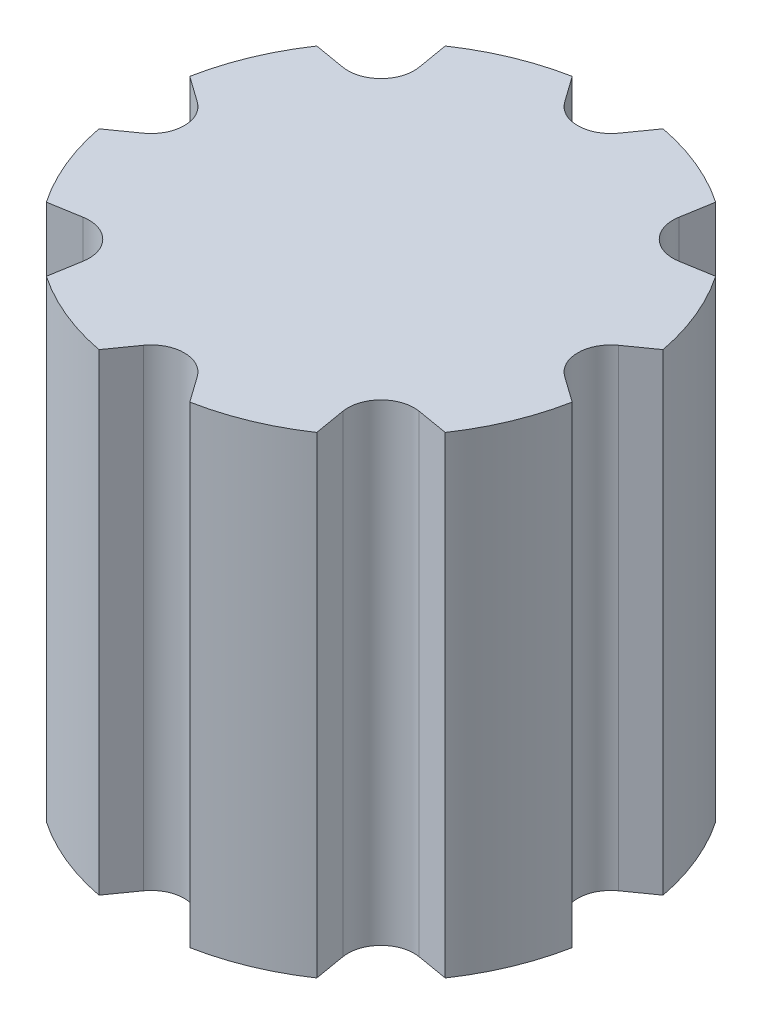
ISO-10303-21;
HEADER;
FILE_DESCRIPTION(('STEP AP214'),'2;1');
FILE_NAME('part.step','',(''),(''),'','','');
FILE_SCHEMA(('AUTOMOTIVE_DESIGN { 1 0 10303 214 1 1 1 1 }'));
ENDSEC;
DATA;
#1=APPLICATION_CONTEXT('core data for automotive mechanical design processes');
#2=APPLICATION_PROTOCOL_DEFINITION('international standard','automotive_design',2000,#1);
#3=PRODUCT_CONTEXT('',#1,'mechanical');
#4=PRODUCT('Part','Part','',(#3));
#5=PRODUCT_RELATED_PRODUCT_CATEGORY('part','',(#4));
#6=PRODUCT_DEFINITION_FORMATION('','',#4);
#7=PRODUCT_DEFINITION_CONTEXT('part definition',#1,'design');
#8=PRODUCT_DEFINITION('design','',#6,#7);
#9=PRODUCT_DEFINITION_SHAPE('','',#8);
#10=(LENGTH_UNIT() NAMED_UNIT(*) SI_UNIT(.MILLI.,.METRE.));
#11=(NAMED_UNIT(*) PLANE_ANGLE_UNIT() SI_UNIT($,.RADIAN.));
#12=(NAMED_UNIT(*) SI_UNIT($,.STERADIAN.) SOLID_ANGLE_UNIT());
#13=UNCERTAINTY_MEASURE_WITH_UNIT(LENGTH_MEASURE(1.E-05),#10,'distance_accuracy_value','');
#14=(GEOMETRIC_REPRESENTATION_CONTEXT(3) GLOBAL_UNCERTAINTY_ASSIGNED_CONTEXT((#13)) GLOBAL_UNIT_ASSIGNED_CONTEXT((#10,
#11,#12)) REPRESENTATION_CONTEXT('',''));
#15=CARTESIAN_POINT('',(0.,0.,0.));
#16=DIRECTION('',(0.,0.,1.));
#17=DIRECTION('',(1.,0.,0.));
#18=AXIS2_PLACEMENT_3D('',#15,#16,#17);
#19=CARTESIAN_POINT('',(-4.86362386118497,10.,0.));
#20=DIRECTION('',(0.,-1.,0.));
#21=DIRECTION('',(0.,0.,-1.));
#22=AXIS2_PLACEMENT_3D('',#19,#20,#21);
#23=CYLINDRICAL_SURFACE('',#22,0.699999999999999);
#24=CARTESIAN_POINT('',(-4.86362386118497,0.,0.));
#25=DIRECTION('',(0.,1.,0.));
#26=DIRECTION('',(0.,0.,1.));
#27=AXIS2_PLACEMENT_3D('',#24,#25,#26);
#28=CIRCLE('',#27,0.699999999999999);
#29=CARTESIAN_POINT('',(-4.45835483640401,0.,0.570751274683722));
#30=VERTEX_POINT('',#29);
#31=CARTESIAN_POINT('',(-4.45835483640401,0.,-0.570751274683713));
#32=VERTEX_POINT('',#31);
#33=EDGE_CURVE('E275',#30,#32,#28,.T.);
#34=ORIENTED_EDGE('',*,*,#33,.F.);
#35=DIRECTION('',(0.,-1.,0.));
#36=VECTOR('',#35,1.);
#37=CARTESIAN_POINT('',(-4.45835483640401,10.,0.570751274683722));
#38=LINE('',#37,#36);
#39=CARTESIAN_POINT('',(-4.45835483640401,10.,0.570751274683722));
#40=VERTEX_POINT('',#39);
#41=EDGE_CURVE('E11',#40,#30,#38,.T.);
#42=ORIENTED_EDGE('',*,*,#41,.F.);
#43=CARTESIAN_POINT('',(-4.86362386118497,10.,0.));
#44=DIRECTION('',(0.,1.,0.));
#45=DIRECTION('',(0.,0.,1.));
#46=AXIS2_PLACEMENT_3D('',#43,#44,#45);
#47=CIRCLE('',#46,0.699999999999999);
#48=CARTESIAN_POINT('',(-4.45835483640401,10.,-0.570751274683713));
#49=VERTEX_POINT('',#48);
#50=EDGE_CURVE('E355',#40,#49,#47,.T.);
#51=ORIENTED_EDGE('',*,*,#50,.T.);
#52=DIRECTION('',(0.,-1.,0.));
#53=VECTOR('',#52,1.);
#54=CARTESIAN_POINT('',(-4.45835483640401,10.,-0.570751274683713));
#55=LINE('',#54,#53);
#56=EDGE_CURVE('E50',#49,#32,#55,.T.);
#57=ORIENTED_EDGE('',*,*,#56,.T.);
#58=EDGE_LOOP('',(#34,#42,#51,#57));
#59=FACE_BOUND('',#58,.T.);
#60=ADVANCED_FACE('F34',(#59),#23,.F.);
#61=CARTESIAN_POINT('',(-1.22496789044554,10.,-1.72515524791535));
#62=DIRECTION('',(-0.578955749687089,0.,-0.815358963833881));
#63=DIRECTION('',(-0.815358963833881,0.,0.578955749687089));
#64=AXIS2_PLACEMENT_3D('',#61,#62,#63);
#65=PLANE('',#64);
#66=DIRECTION('',(0.815358963833881,0.,-0.578955749687089));
#67=VECTOR('',#66,1.);
#68=CARTESIAN_POINT('',(-1.22496789044554,0.,-1.72515524791535));
#69=LINE('',#68,#67);
#70=CARTESIAN_POINT('',(-5.00855794626553,0.,0.961429820059898));
#71=VERTEX_POINT('',#70);
#72=EDGE_CURVE('E277',#71,#30,#69,.T.);
#73=ORIENTED_EDGE('',*,*,#72,.F.);
#74=DIRECTION('',(0.,-1.,0.));
#75=VECTOR('',#74,1.);
#76=CARTESIAN_POINT('',(-5.00855794626553,10.,0.961429820059898));
#77=LINE('',#76,#75);
#78=CARTESIAN_POINT('',(-5.00855794626553,10.,0.961429820059898));
#79=VERTEX_POINT('',#78);
#80=EDGE_CURVE('E42',#79,#71,#77,.T.);
#81=ORIENTED_EDGE('',*,*,#80,.F.);
#82=DIRECTION('',(0.815358963833881,0.,-0.578955749687089));
#83=VECTOR('',#82,1.);
#84=CARTESIAN_POINT('',(-1.22496789044554,10.,-1.72515524791535));
#85=LINE('',#84,#83);
#86=EDGE_CURVE('E423',#79,#40,#85,.T.);
#87=ORIENTED_EDGE('',*,*,#86,.T.);
#88=ORIENTED_EDGE('',*,*,#41,.T.);
#89=EDGE_LOOP('',(#73,#81,#87,#88));
#90=FACE_BOUND('',#89,.T.);
#91=ADVANCED_FACE('F422',(#90),#65,.T.);
#92=CARTESIAN_POINT('',(0.,10.,0.));
#93=DIRECTION('',(0.,-1.,0.));
#94=DIRECTION('',(0.,0.,-1.));
#95=AXIS2_PLACEMENT_3D('',#92,#93,#94);
#96=CYLINDRICAL_SURFACE('',#95,5.1);
#97=CARTESIAN_POINT('',(0.,0.,0.));
#98=DIRECTION('',(0.,1.,0.));
#99=DIRECTION('',(0.,0.,1.));
#100=AXIS2_PLACEMENT_3D('',#97,#98,#99);
#101=CIRCLE('',#100,5.1);
#102=CARTESIAN_POINT('',(-4.22141883316943,0.,2.86175174237082));
#103=VERTEX_POINT('',#102);
#104=EDGE_CURVE('E281',#71,#103,#101,.T.);
#105=ORIENTED_EDGE('',*,*,#104,.T.);
#106=DIRECTION('',(0.,-1.,0.));
#107=VECTOR('',#106,1.);
#108=CARTESIAN_POINT('',(-4.22141883316943,10.,2.86175174237082));
#109=LINE('',#108,#107);
#110=CARTESIAN_POINT('',(-4.22141883316943,10.,2.86175174237082));
#111=VERTEX_POINT('',#110);
#112=EDGE_CURVE('E409',#111,#103,#109,.T.);
#113=ORIENTED_EDGE('',*,*,#112,.F.);
#114=CARTESIAN_POINT('',(0.,10.,0.));
#115=DIRECTION('',(0.,1.,0.));
#116=DIRECTION('',(0.,0.,1.));
#117=AXIS2_PLACEMENT_3D('',#114,#115,#116);
#118=CIRCLE('',#117,5.1);
#119=EDGE_CURVE('E263',#79,#111,#118,.T.);
#120=ORIENTED_EDGE('',*,*,#119,.F.);
#121=ORIENTED_EDGE('',*,*,#80,.T.);
#122=EDGE_LOOP('',(#105,#113,#120,#121));
#123=FACE_BOUND('',#122,.T.);
#124=ADVANCED_FACE('F413',(#123),#96,.T.);
#125=CARTESIAN_POINT('',(0.353685872330692,10.,2.08605207647032));
#126=DIRECTION('',(0.167162315817496,0.,0.985929389038856));
#127=DIRECTION('',(0.985929389038856,0.,-0.167162315817496));
#128=AXIS2_PLACEMENT_3D('',#125,#126,#127);
#129=PLANE('',#128);
#130=DIRECTION('',(-0.985929389038856,0.,0.167162315817496));
#131=VECTOR('',#130,1.);
#132=CARTESIAN_POINT('',(0.353685872330692,0.,2.08605207647032));
#133=LINE('',#132,#131);
#134=CARTESIAN_POINT('',(-3.55611503445683,0.,2.7489508410574));
#135=VERTEX_POINT('',#134);
#136=EDGE_CURVE('E284',#135,#103,#133,.T.);
#137=ORIENTED_EDGE('',*,*,#136,.F.);
#138=DIRECTION('',(0.,-1.,0.));
#139=VECTOR('',#138,1.);
#140=CARTESIAN_POINT('',(-3.55611503445683,10.,2.7489508410574));
#141=LINE('',#140,#139);
#142=CARTESIAN_POINT('',(-3.55611503445683,10.,2.7489508410574));
#143=VERTEX_POINT('',#142);
#144=EDGE_CURVE('E407',#143,#135,#141,.T.);
#145=ORIENTED_EDGE('',*,*,#144,.F.);
#146=DIRECTION('',(-0.985929389038856,0.,0.167162315817496));
#147=VECTOR('',#146,1.);
#148=CARTESIAN_POINT('',(0.353685872330692,10.,2.08605207647032));
#149=LINE('',#148,#147);
#150=EDGE_CURVE('E588',#143,#111,#149,.T.);
#151=ORIENTED_EDGE('',*,*,#150,.T.);
#152=ORIENTED_EDGE('',*,*,#112,.T.);
#153=EDGE_LOOP('',(#137,#145,#151,#152));
#154=FACE_BOUND('',#153,.T.);
#155=ADVANCED_FACE('F442',(#154),#129,.T.);
#156=CARTESIAN_POINT('',(-3.43910141338459,10.,3.43910141338459));
#157=DIRECTION('',(0.,-1.,0.));
#158=DIRECTION('',(0.,0.,-1.));
#159=AXIS2_PLACEMENT_3D('',#156,#157,#158);
#160=CYLINDRICAL_SURFACE('',#159,0.699999999999999);
#161=CARTESIAN_POINT('',(-3.43910141338459,0.,3.43910141338459));
#162=DIRECTION('',(0.,1.,0.));
#163=DIRECTION('',(0.,0.,1.));
#164=AXIS2_PLACEMENT_3D('',#161,#162,#163);
#165=CIRCLE('',#164,0.699999999999999);
#166=CARTESIAN_POINT('',(-2.74895084105739,0.,3.55611503445684));
#167=VERTEX_POINT('',#166);
#168=EDGE_CURVE('E289',#167,#135,#165,.T.);
#169=ORIENTED_EDGE('',*,*,#168,.F.);
#170=DIRECTION('',(0.,-1.,0.));
#171=VECTOR('',#170,1.);
#172=CARTESIAN_POINT('',(-2.74895084105739,10.,3.55611503445684));
#173=LINE('',#172,#171);
#174=CARTESIAN_POINT('',(-2.74895084105739,10.,3.55611503445684));
#175=VERTEX_POINT('',#174);
#176=EDGE_CURVE('E405',#175,#167,#173,.T.);
#177=ORIENTED_EDGE('',*,*,#176,.F.);
#178=CARTESIAN_POINT('',(-3.43910141338459,10.,3.43910141338459));
#179=DIRECTION('',(0.,1.,0.));
#180=DIRECTION('',(0.,0.,1.));
#181=AXIS2_PLACEMENT_3D('',#178,#179,#180);
#182=CIRCLE('',#181,0.699999999999999);
#183=EDGE_CURVE('E592',#175,#143,#182,.T.);
#184=ORIENTED_EDGE('',*,*,#183,.T.);
#185=ORIENTED_EDGE('',*,*,#144,.T.);
#186=EDGE_LOOP('',(#169,#177,#184,#185));
#187=FACE_BOUND('',#186,.T.);
#188=ADVANCED_FACE('F447',(#187),#160,.F.);
#189=CARTESIAN_POINT('',(-2.08605207647033,10.,-0.353685872330685));
#190=DIRECTION('',(-0.985929389038857,0.,-0.167162315817492));
#191=DIRECTION('',(-0.167162315817492,0.,0.985929389038857));
#192=AXIS2_PLACEMENT_3D('',#189,#190,#191);
#193=PLANE('',#192);
#194=DIRECTION('',(0.167162315817492,0.,-0.985929389038857));
#195=VECTOR('',#194,1.);
#196=CARTESIAN_POINT('',(-2.08605207647033,0.,-0.353685872330685));
#197=LINE('',#196,#195);
#198=CARTESIAN_POINT('',(-2.86175174237081,0.,4.22141883316944));
#199=VERTEX_POINT('',#198);
#200=EDGE_CURVE('E292',#199,#167,#197,.T.);
#201=ORIENTED_EDGE('',*,*,#200,.F.);
#202=DIRECTION('',(0.,-1.,0.));
#203=VECTOR('',#202,1.);
#204=CARTESIAN_POINT('',(-2.86175174237081,10.,4.22141883316944));
#205=LINE('',#204,#203);
#206=CARTESIAN_POINT('',(-2.86175174237081,10.,4.22141883316944));
#207=VERTEX_POINT('',#206);
#208=EDGE_CURVE('E403',#207,#199,#205,.T.);
#209=ORIENTED_EDGE('',*,*,#208,.F.);
#210=DIRECTION('',(0.167162315817492,0.,-0.985929389038857));
#211=VECTOR('',#210,1.);
#212=CARTESIAN_POINT('',(-2.08605207647033,10.,-0.353685872330685));
#213=LINE('',#212,#211);
#214=EDGE_CURVE('E595',#207,#175,#213,.T.);
#215=ORIENTED_EDGE('',*,*,#214,.T.);
#216=ORIENTED_EDGE('',*,*,#176,.T.);
#217=EDGE_LOOP('',(#201,#209,#215,#216));
#218=FACE_BOUND('',#217,.T.);
#219=ADVANCED_FACE('F451',(#218),#193,.T.);
#220=CARTESIAN_POINT('',(-0.961429820059888,0.,5.00855794626553));
#221=VERTEX_POINT('',#220);
#222=EDGE_CURVE('E286',#199,#221,#101,.T.);
#223=ORIENTED_EDGE('',*,*,#222,.T.);
#224=DIRECTION('',(0.,-1.,0.));
#225=VECTOR('',#224,1.);
#226=CARTESIAN_POINT('',(-0.961429820059888,10.,5.00855794626553));
#227=LINE('',#226,#225);
#228=CARTESIAN_POINT('',(-0.961429820059888,10.,5.00855794626553));
#229=VERTEX_POINT('',#228);
#230=EDGE_CURVE('E401',#229,#221,#227,.T.);
#231=ORIENTED_EDGE('',*,*,#230,.F.);
#232=EDGE_CURVE('E589',#207,#229,#118,.T.);
#233=ORIENTED_EDGE('',*,*,#232,.F.);
#234=ORIENTED_EDGE('',*,*,#208,.T.);
#235=EDGE_LOOP('',(#223,#231,#233,#234));
#236=FACE_BOUND('',#235,.T.);
#237=ADVANCED_FACE('F443',(#236),#96,.T.);
#238=CARTESIAN_POINT('',(1.72515524791535,10.,1.22496789044553));
#239=DIRECTION('',(0.815358963833883,0.,0.578955749687087));
#240=DIRECTION('',(0.578955749687087,0.,-0.815358963833883));
#241=AXIS2_PLACEMENT_3D('',#238,#239,#240);
#242=PLANE('',#241);
#243=DIRECTION('',(-0.578955749687087,0.,0.815358963833883));
#244=VECTOR('',#243,1.);
#245=CARTESIAN_POINT('',(1.72515524791535,0.,1.22496789044553));
#246=LINE('',#245,#244);
#247=CARTESIAN_POINT('',(-0.570751274683713,0.,4.45835483640401));
#248=VERTEX_POINT('',#247);
#249=EDGE_CURVE('E295',#248,#221,#246,.T.);
#250=ORIENTED_EDGE('',*,*,#249,.F.);
#251=DIRECTION('',(0.,-1.,0.));
#252=VECTOR('',#251,1.);
#253=CARTESIAN_POINT('',(-0.570751274683713,10.,4.45835483640401));
#254=LINE('',#253,#252);
#255=CARTESIAN_POINT('',(-0.570751274683713,10.,4.45835483640401));
#256=VERTEX_POINT('',#255);
#257=EDGE_CURVE('E399',#256,#248,#254,.T.);
#258=ORIENTED_EDGE('',*,*,#257,.F.);
#259=DIRECTION('',(-0.578955749687087,0.,0.815358963833883));
#260=VECTOR('',#259,1.);
#261=CARTESIAN_POINT('',(1.72515524791535,10.,1.22496789044553));
#262=LINE('',#261,#260);
#263=EDGE_CURVE('E598',#256,#229,#262,.T.);
#264=ORIENTED_EDGE('',*,*,#263,.T.);
#265=ORIENTED_EDGE('',*,*,#230,.T.);
#266=EDGE_LOOP('',(#250,#258,#264,#265));
#267=FACE_BOUND('',#266,.T.);
#268=ADVANCED_FACE('F456',(#267),#242,.T.);
#269=CARTESIAN_POINT('',(0.,10.,4.86362386118497));
#270=DIRECTION('',(0.,-1.,0.));
#271=DIRECTION('',(0.,0.,-1.));
#272=AXIS2_PLACEMENT_3D('',#269,#270,#271);
#273=CYLINDRICAL_SURFACE('',#272,0.699999999999999);
#274=CARTESIAN_POINT('',(0.,0.,4.86362386118497));
#275=DIRECTION('',(0.,1.,0.));
#276=DIRECTION('',(0.,0.,1.));
#277=AXIS2_PLACEMENT_3D('',#274,#275,#276);
#278=CIRCLE('',#277,0.699999999999999);
#279=CARTESIAN_POINT('',(0.57075127468372,0.,4.45835483640401));
#280=VERTEX_POINT('',#279);
#281=EDGE_CURVE('E298',#280,#248,#278,.T.);
#282=ORIENTED_EDGE('',*,*,#281,.F.);
#283=DIRECTION('',(0.,-1.,0.));
#284=VECTOR('',#283,1.);
#285=CARTESIAN_POINT('',(0.57075127468372,10.,4.45835483640401));
#286=LINE('',#285,#284);
#287=CARTESIAN_POINT('',(0.57075127468372,10.,4.45835483640401));
#288=VERTEX_POINT('',#287);
#289=EDGE_CURVE('E397',#288,#280,#286,.T.);
#290=ORIENTED_EDGE('',*,*,#289,.F.);
#291=CARTESIAN_POINT('',(0.,10.,4.86362386118497));
#292=DIRECTION('',(0.,1.,0.));
#293=DIRECTION('',(0.,0.,1.));
#294=AXIS2_PLACEMENT_3D('',#291,#292,#293);
#295=CIRCLE('',#294,0.699999999999999);
#296=EDGE_CURVE('E601',#288,#256,#295,.T.);
#297=ORIENTED_EDGE('',*,*,#296,.T.);
#298=ORIENTED_EDGE('',*,*,#257,.T.);
#299=EDGE_LOOP('',(#282,#290,#297,#298));
#300=FACE_BOUND('',#299,.T.);
#301=ADVANCED_FACE('F459',(#300),#273,.F.);
#302=CARTESIAN_POINT('',(-1.72515524791536,10.,1.22496789044554));
#303=DIRECTION('',(-0.815358963833881,0.,0.57895574968709));
#304=DIRECTION('',(0.57895574968709,0.,0.815358963833881));
#305=AXIS2_PLACEMENT_3D('',#302,#303,#304);
#306=PLANE('',#305);
#307=DIRECTION('',(-0.57895574968709,0.,-0.815358963833881));
#308=VECTOR('',#307,1.);
#309=CARTESIAN_POINT('',(-1.72515524791536,0.,1.22496789044554));
#310=LINE('',#309,#308);
#311=CARTESIAN_POINT('',(0.961429820059896,0.,5.00855794626553));
#312=VERTEX_POINT('',#311);
#313=EDGE_CURVE('E301',#312,#280,#310,.T.);
#314=ORIENTED_EDGE('',*,*,#313,.F.);
#315=DIRECTION('',(0.,-1.,0.));
#316=VECTOR('',#315,1.);
#317=CARTESIAN_POINT('',(0.961429820059896,10.,5.00855794626553));
#318=LINE('',#317,#316);
#319=CARTESIAN_POINT('',(0.961429820059896,10.,5.00855794626553));
#320=VERTEX_POINT('',#319);
#321=EDGE_CURVE('E395',#320,#312,#318,.T.);
#322=ORIENTED_EDGE('',*,*,#321,.F.);
#323=DIRECTION('',(-0.57895574968709,0.,-0.815358963833881));
#324=VECTOR('',#323,1.);
#325=CARTESIAN_POINT('',(-1.72515524791536,10.,1.22496789044554));
#326=LINE('',#325,#324);
#327=EDGE_CURVE('E604',#320,#288,#326,.T.);
#328=ORIENTED_EDGE('',*,*,#327,.T.);
#329=ORIENTED_EDGE('',*,*,#289,.T.);
#330=EDGE_LOOP('',(#314,#322,#328,#329));
#331=FACE_BOUND('',#330,.T.);
#332=ADVANCED_FACE('F463',(#331),#306,.T.);
#333=CARTESIAN_POINT('',(2.86175174237082,0.,4.22141883316943));
#334=VERTEX_POINT('',#333);
#335=EDGE_CURVE('E304',#312,#334,#101,.T.);
#336=ORIENTED_EDGE('',*,*,#335,.T.);
#337=DIRECTION('',(0.,-1.,0.));
#338=VECTOR('',#337,1.);
#339=CARTESIAN_POINT('',(2.86175174237082,10.,4.22141883316943));
#340=LINE('',#339,#338);
#341=CARTESIAN_POINT('',(2.86175174237082,10.,4.22141883316943));
#342=VERTEX_POINT('',#341);
#343=EDGE_CURVE('E393',#342,#334,#340,.T.);
#344=ORIENTED_EDGE('',*,*,#343,.F.);
#345=EDGE_CURVE('E607',#320,#342,#118,.T.);
#346=ORIENTED_EDGE('',*,*,#345,.F.);
#347=ORIENTED_EDGE('',*,*,#321,.T.);
#348=EDGE_LOOP('',(#336,#344,#346,#347));
#349=FACE_BOUND('',#348,.T.);
#350=ADVANCED_FACE('F467',(#349),#96,.T.);
#351=CARTESIAN_POINT('',(2.08605207647032,10.,-0.353685872330692));
#352=DIRECTION('',(0.985929389038856,0.,-0.167162315817496));
#353=DIRECTION('',(-0.167162315817496,0.,-0.985929389038856));
#354=AXIS2_PLACEMENT_3D('',#351,#352,#353);
#355=PLANE('',#354);
#356=DIRECTION('',(0.167162315817496,0.,0.985929389038856));
#357=VECTOR('',#356,1.);
#358=CARTESIAN_POINT('',(2.08605207647032,0.,-0.353685872330692));
#359=LINE('',#358,#357);
#360=CARTESIAN_POINT('',(2.74895084105739,0.,3.55611503445683));
#361=VERTEX_POINT('',#360);
#362=EDGE_CURVE('E305',#361,#334,#359,.T.);
#363=ORIENTED_EDGE('',*,*,#362,.F.);
#364=DIRECTION('',(0.,-1.,0.));
#365=VECTOR('',#364,1.);
#366=CARTESIAN_POINT('',(2.74895084105739,10.,3.55611503445683));
#367=LINE('',#366,#365);
#368=CARTESIAN_POINT('',(2.74895084105739,10.,3.55611503445683));
#369=VERTEX_POINT('',#368);
#370=EDGE_CURVE('E391',#369,#361,#367,.T.);
#371=ORIENTED_EDGE('',*,*,#370,.F.);
#372=DIRECTION('',(0.167162315817496,0.,0.985929389038856));
#373=VECTOR('',#372,1.);
#374=CARTESIAN_POINT('',(2.08605207647032,10.,-0.353685872330692));
#375=LINE('',#374,#373);
#376=EDGE_CURVE('E608',#369,#342,#375,.T.);
#377=ORIENTED_EDGE('',*,*,#376,.T.);
#378=ORIENTED_EDGE('',*,*,#343,.T.);
#379=EDGE_LOOP('',(#363,#371,#377,#378));
#380=FACE_BOUND('',#379,.T.);
#381=ADVANCED_FACE('F469',(#380),#355,.T.);
#382=CARTESIAN_POINT('',(3.43910141338459,10.,3.43910141338459));
#383=DIRECTION('',(0.,-1.,0.));
#384=DIRECTION('',(0.,0.,-1.));
#385=AXIS2_PLACEMENT_3D('',#382,#383,#384);
#386=CYLINDRICAL_SURFACE('',#385,0.699999999999999);
#387=CARTESIAN_POINT('',(3.43910141338459,0.,3.43910141338459));
#388=DIRECTION('',(0.,1.,0.));
#389=DIRECTION('',(0.,0.,1.));
#390=AXIS2_PLACEMENT_3D('',#387,#388,#389);
#391=CIRCLE('',#390,0.699999999999999);
#392=CARTESIAN_POINT('',(3.55611503445684,0.,2.74895084105739));
#393=VERTEX_POINT('',#392);
#394=EDGE_CURVE('E308',#393,#361,#391,.T.);
#395=ORIENTED_EDGE('',*,*,#394,.F.);
#396=DIRECTION('',(0.,-1.,0.));
#397=VECTOR('',#396,1.);
#398=CARTESIAN_POINT('',(3.55611503445684,10.,2.74895084105739));
#399=LINE('',#398,#397);
#400=CARTESIAN_POINT('',(3.55611503445684,10.,2.74895084105739));
#401=VERTEX_POINT('',#400);
#402=EDGE_CURVE('E389',#401,#393,#399,.T.);
#403=ORIENTED_EDGE('',*,*,#402,.F.);
#404=CARTESIAN_POINT('',(3.43910141338459,10.,3.43910141338459));
#405=DIRECTION('',(0.,1.,0.));
#406=DIRECTION('',(0.,0.,1.));
#407=AXIS2_PLACEMENT_3D('',#404,#405,#406);
#408=CIRCLE('',#407,0.699999999999999);
#409=EDGE_CURVE('E611',#401,#369,#408,.T.);
#410=ORIENTED_EDGE('',*,*,#409,.T.);
#411=ORIENTED_EDGE('',*,*,#370,.T.);
#412=EDGE_LOOP('',(#395,#403,#410,#411));
#413=FACE_BOUND('',#412,.T.);
#414=ADVANCED_FACE('F472',(#413),#386,.F.);
#415=CARTESIAN_POINT('',(-0.353685872330685,10.,2.08605207647033));
#416=DIRECTION('',(-0.167162315817492,0.,0.985929389038857));
#417=DIRECTION('',(0.985929389038857,0.,0.167162315817492));
#418=AXIS2_PLACEMENT_3D('',#415,#416,#417);
#419=PLANE('',#418);
#420=DIRECTION('',(-0.985929389038857,0.,-0.167162315817492));
#421=VECTOR('',#420,1.);
#422=CARTESIAN_POINT('',(-0.353685872330685,0.,2.08605207647033));
#423=LINE('',#422,#421);
#424=CARTESIAN_POINT('',(4.22141883316944,0.,2.86175174237081));
#425=VERTEX_POINT('',#424);
#426=EDGE_CURVE('E311',#425,#393,#423,.T.);
#427=ORIENTED_EDGE('',*,*,#426,.F.);
#428=DIRECTION('',(0.,-1.,0.));
#429=VECTOR('',#428,1.);
#430=CARTESIAN_POINT('',(4.22141883316944,10.,2.86175174237081));
#431=LINE('',#430,#429);
#432=CARTESIAN_POINT('',(4.22141883316944,10.,2.86175174237081));
#433=VERTEX_POINT('',#432);
#434=EDGE_CURVE('E387',#433,#425,#431,.T.);
#435=ORIENTED_EDGE('',*,*,#434,.F.);
#436=DIRECTION('',(-0.985929389038857,0.,-0.167162315817492));
#437=VECTOR('',#436,1.);
#438=CARTESIAN_POINT('',(-0.353685872330685,10.,2.08605207647033));
#439=LINE('',#438,#437);
#440=EDGE_CURVE('E614',#433,#401,#439,.T.);
#441=ORIENTED_EDGE('',*,*,#440,.T.);
#442=ORIENTED_EDGE('',*,*,#402,.T.);
#443=EDGE_LOOP('',(#427,#435,#441,#442));
#444=FACE_BOUND('',#443,.T.);
#445=ADVANCED_FACE('F476',(#444),#419,.T.);
#446=CARTESIAN_POINT('',(5.00855794626553,0.,0.961429820059887));
#447=VERTEX_POINT('',#446);
#448=EDGE_CURVE('E314',#425,#447,#101,.T.);
#449=ORIENTED_EDGE('',*,*,#448,.T.);
#450=DIRECTION('',(0.,-1.,0.));
#451=VECTOR('',#450,1.);
#452=CARTESIAN_POINT('',(5.00855794626553,10.,0.961429820059887));
#453=LINE('',#452,#451);
#454=CARTESIAN_POINT('',(5.00855794626553,10.,0.961429820059887));
#455=VERTEX_POINT('',#454);
#456=EDGE_CURVE('E385',#455,#447,#453,.T.);
#457=ORIENTED_EDGE('',*,*,#456,.F.);
#458=EDGE_CURVE('E617',#433,#455,#118,.T.);
#459=ORIENTED_EDGE('',*,*,#458,.F.);
#460=ORIENTED_EDGE('',*,*,#434,.T.);
#461=EDGE_LOOP('',(#449,#457,#459,#460));
#462=FACE_BOUND('',#461,.T.);
#463=ADVANCED_FACE('F480',(#462),#96,.T.);
#464=CARTESIAN_POINT('',(1.22496789044553,10.,-1.72515524791535));
#465=DIRECTION('',(0.578955749687087,0.,-0.815358963833883));
#466=DIRECTION('',(-0.815358963833883,0.,-0.578955749687087));
#467=AXIS2_PLACEMENT_3D('',#464,#465,#466);
#468=PLANE('',#467);
#469=DIRECTION('',(0.815358963833883,0.,0.578955749687087));
#470=VECTOR('',#469,1.);
#471=CARTESIAN_POINT('',(1.22496789044553,0.,-1.72515524791535));
#472=LINE('',#471,#470);
#473=CARTESIAN_POINT('',(4.45835483640401,0.,0.570751274683712));
#474=VERTEX_POINT('',#473);
#475=EDGE_CURVE('E315',#474,#447,#472,.T.);
#476=ORIENTED_EDGE('',*,*,#475,.F.);
#477=DIRECTION('',(0.,-1.,0.));
#478=VECTOR('',#477,1.);
#479=CARTESIAN_POINT('',(4.45835483640401,10.,0.570751274683712));
#480=LINE('',#479,#478);
#481=CARTESIAN_POINT('',(4.45835483640401,10.,0.570751274683712));
#482=VERTEX_POINT('',#481);
#483=EDGE_CURVE('E383',#482,#474,#480,.T.);
#484=ORIENTED_EDGE('',*,*,#483,.F.);
#485=DIRECTION('',(0.815358963833883,0.,0.578955749687087));
#486=VECTOR('',#485,1.);
#487=CARTESIAN_POINT('',(1.22496789044553,10.,-1.72515524791535));
#488=LINE('',#487,#486);
#489=EDGE_CURVE('E618',#482,#455,#488,.T.);
#490=ORIENTED_EDGE('',*,*,#489,.T.);
#491=ORIENTED_EDGE('',*,*,#456,.T.);
#492=EDGE_LOOP('',(#476,#484,#490,#491));
#493=FACE_BOUND('',#492,.T.);
#494=ADVANCED_FACE('F482',(#493),#468,.T.);
#495=CARTESIAN_POINT('',(4.86362386118497,10.,0.));
#496=DIRECTION('',(0.,-1.,0.));
#497=DIRECTION('',(0.,0.,-1.));
#498=AXIS2_PLACEMENT_3D('',#495,#496,#497);
#499=CYLINDRICAL_SURFACE('',#498,0.699999999999999);
#500=CARTESIAN_POINT('',(4.86362386118497,0.,0.));
#501=DIRECTION('',(0.,1.,0.));
#502=DIRECTION('',(0.,0.,1.));
#503=AXIS2_PLACEMENT_3D('',#500,#501,#502);
#504=CIRCLE('',#503,0.699999999999999);
#505=CARTESIAN_POINT('',(4.45835483640401,0.,-0.570751274683719));
#506=VERTEX_POINT('',#505);
#507=EDGE_CURVE('E318',#506,#474,#504,.T.);
#508=ORIENTED_EDGE('',*,*,#507,.F.);
#509=DIRECTION('',(0.,-1.,0.));
#510=VECTOR('',#509,1.);
#511=CARTESIAN_POINT('',(4.45835483640401,10.,-0.570751274683719));
#512=LINE('',#511,#510);
#513=CARTESIAN_POINT('',(4.45835483640401,10.,-0.570751274683719));
#514=VERTEX_POINT('',#513);
#515=EDGE_CURVE('E381',#514,#506,#512,.T.);
#516=ORIENTED_EDGE('',*,*,#515,.F.);
#517=CARTESIAN_POINT('',(4.86362386118497,10.,0.));
#518=DIRECTION('',(0.,1.,0.));
#519=DIRECTION('',(0.,0.,1.));
#520=AXIS2_PLACEMENT_3D('',#517,#518,#519);
#521=CIRCLE('',#520,0.699999999999999);
#522=EDGE_CURVE('E621',#514,#482,#521,.T.);
#523=ORIENTED_EDGE('',*,*,#522,.T.);
#524=ORIENTED_EDGE('',*,*,#483,.T.);
#525=EDGE_LOOP('',(#508,#516,#523,#524));
#526=FACE_BOUND('',#525,.T.);
#527=ADVANCED_FACE('F485',(#526),#499,.F.);
#528=CARTESIAN_POINT('',(1.22496789044554,10.,1.72515524791536));
#529=DIRECTION('',(0.57895574968709,0.,0.815358963833881));
#530=DIRECTION('',(0.815358963833881,0.,-0.57895574968709));
#531=AXIS2_PLACEMENT_3D('',#528,#529,#530);
#532=PLANE('',#531);
#533=DIRECTION('',(-0.815358963833881,0.,0.57895574968709));
#534=VECTOR('',#533,1.);
#535=CARTESIAN_POINT('',(1.22496789044554,0.,1.72515524791536));
#536=LINE('',#535,#534);
#537=CARTESIAN_POINT('',(5.00855794626553,0.,-0.961429820059895));
#538=VERTEX_POINT('',#537);
#539=EDGE_CURVE('E321',#538,#506,#536,.T.);
#540=ORIENTED_EDGE('',*,*,#539,.F.);
#541=DIRECTION('',(0.,-1.,0.));
#542=VECTOR('',#541,1.);
#543=CARTESIAN_POINT('',(5.00855794626553,10.,-0.961429820059895));
#544=LINE('',#543,#542);
#545=CARTESIAN_POINT('',(5.00855794626553,10.,-0.961429820059895));
#546=VERTEX_POINT('',#545);
#547=EDGE_CURVE('E379',#546,#538,#544,.T.);
#548=ORIENTED_EDGE('',*,*,#547,.F.);
#549=DIRECTION('',(-0.815358963833881,0.,0.57895574968709));
#550=VECTOR('',#549,1.);
#551=CARTESIAN_POINT('',(1.22496789044554,10.,1.72515524791536));
#552=LINE('',#551,#550);
#553=EDGE_CURVE('E624',#546,#514,#552,.T.);
#554=ORIENTED_EDGE('',*,*,#553,.T.);
#555=ORIENTED_EDGE('',*,*,#515,.T.);
#556=EDGE_LOOP('',(#540,#548,#554,#555));
#557=FACE_BOUND('',#556,.T.);
#558=ADVANCED_FACE('F489',(#557),#532,.T.);
#559=CARTESIAN_POINT('',(4.22141883316943,0.,-2.86175174237082));
#560=VERTEX_POINT('',#559);
#561=EDGE_CURVE('E324',#538,#560,#101,.T.);
#562=ORIENTED_EDGE('',*,*,#561,.T.);
#563=DIRECTION('',(0.,-1.,0.));
#564=VECTOR('',#563,1.);
#565=CARTESIAN_POINT('',(4.22141883316943,10.,-2.86175174237082));
#566=LINE('',#565,#564);
#567=CARTESIAN_POINT('',(4.22141883316943,10.,-2.86175174237082));
#568=VERTEX_POINT('',#567);
#569=EDGE_CURVE('E377',#568,#560,#566,.T.);
#570=ORIENTED_EDGE('',*,*,#569,.F.);
#571=EDGE_CURVE('E627',#546,#568,#118,.T.);
#572=ORIENTED_EDGE('',*,*,#571,.F.);
#573=ORIENTED_EDGE('',*,*,#547,.T.);
#574=EDGE_LOOP('',(#562,#570,#572,#573));
#575=FACE_BOUND('',#574,.T.);
#576=ADVANCED_FACE('F493',(#575),#96,.T.);
#577=CARTESIAN_POINT('',(-0.353685872330691,10.,-2.08605207647032));
#578=DIRECTION('',(-0.167162315817495,0.,-0.985929389038856));
#579=DIRECTION('',(-0.985929389038856,0.,0.167162315817495));
#580=AXIS2_PLACEMENT_3D('',#577,#578,#579);
#581=PLANE('',#580);
#582=DIRECTION('',(0.985929389038856,0.,-0.167162315817495));
#583=VECTOR('',#582,1.);
#584=CARTESIAN_POINT('',(-0.353685872330691,0.,-2.08605207647032));
#585=LINE('',#584,#583);
#586=CARTESIAN_POINT('',(3.55611503445683,0.,-2.74895084105739));
#587=VERTEX_POINT('',#586);
#588=EDGE_CURVE('E325',#587,#560,#585,.T.);
#589=ORIENTED_EDGE('',*,*,#588,.F.);
#590=DIRECTION('',(0.,-1.,0.));
#591=VECTOR('',#590,1.);
#592=CARTESIAN_POINT('',(3.55611503445683,10.,-2.74895084105739));
#593=LINE('',#592,#591);
#594=CARTESIAN_POINT('',(3.55611503445683,10.,-2.74895084105739));
#595=VERTEX_POINT('',#594);
#596=EDGE_CURVE('E375',#595,#587,#593,.T.);
#597=ORIENTED_EDGE('',*,*,#596,.F.);
#598=DIRECTION('',(0.985929389038856,0.,-0.167162315817495));
#599=VECTOR('',#598,1.);
#600=CARTESIAN_POINT('',(-0.353685872330691,10.,-2.08605207647032));
#601=LINE('',#600,#599);
#602=EDGE_CURVE('E628',#595,#568,#601,.T.);
#603=ORIENTED_EDGE('',*,*,#602,.T.);
#604=ORIENTED_EDGE('',*,*,#569,.T.);
#605=EDGE_LOOP('',(#589,#597,#603,#604));
#606=FACE_BOUND('',#605,.T.);
#607=ADVANCED_FACE('F495',(#606),#581,.T.);
#608=CARTESIAN_POINT('',(3.43910141338459,10.,-3.43910141338459));
#609=DIRECTION('',(0.,-1.,0.));
#610=DIRECTION('',(0.,0.,-1.));
#611=AXIS2_PLACEMENT_3D('',#608,#609,#610);
#612=CYLINDRICAL_SURFACE('',#611,0.699999999999999);
#613=CARTESIAN_POINT('',(3.43910141338459,0.,-3.43910141338459));
#614=DIRECTION('',(0.,1.,0.));
#615=DIRECTION('',(0.,0.,1.));
#616=AXIS2_PLACEMENT_3D('',#613,#614,#615);
#617=CIRCLE('',#616,0.699999999999999);
#618=CARTESIAN_POINT('',(2.74895084105739,0.,-3.55611503445684));
#619=VERTEX_POINT('',#618);
#620=EDGE_CURVE('E328',#619,#587,#617,.T.);
#621=ORIENTED_EDGE('',*,*,#620,.F.);
#622=DIRECTION('',(0.,-1.,0.));
#623=VECTOR('',#622,1.);
#624=CARTESIAN_POINT('',(2.74895084105739,10.,-3.55611503445684));
#625=LINE('',#624,#623);
#626=CARTESIAN_POINT('',(2.74895084105739,10.,-3.55611503445684));
#627=VERTEX_POINT('',#626);
#628=EDGE_CURVE('E373',#627,#619,#625,.T.);
#629=ORIENTED_EDGE('',*,*,#628,.F.);
#630=CARTESIAN_POINT('',(3.43910141338459,10.,-3.43910141338459));
#631=DIRECTION('',(0.,1.,0.));
#632=DIRECTION('',(0.,0.,1.));
#633=AXIS2_PLACEMENT_3D('',#630,#631,#632);
#634=CIRCLE('',#633,0.699999999999999);
#635=EDGE_CURVE('E631',#627,#595,#634,.T.);
#636=ORIENTED_EDGE('',*,*,#635,.T.);
#637=ORIENTED_EDGE('',*,*,#596,.T.);
#638=EDGE_LOOP('',(#621,#629,#636,#637));
#639=FACE_BOUND('',#638,.T.);
#640=ADVANCED_FACE('F498',(#639),#612,.F.);
#641=CARTESIAN_POINT('',(2.08605207647033,10.,0.353685872330685));
#642=DIRECTION('',(0.985929389038857,0.,0.167162315817492));
#643=DIRECTION('',(0.167162315817492,0.,-0.985929389038857));
#644=AXIS2_PLACEMENT_3D('',#641,#642,#643);
#645=PLANE('',#644);
#646=DIRECTION('',(-0.167162315817492,0.,0.985929389038857));
#647=VECTOR('',#646,1.);
#648=CARTESIAN_POINT('',(2.08605207647033,0.,0.353685872330685));
#649=LINE('',#648,#647);
#650=CARTESIAN_POINT('',(2.86175174237081,0.,-4.22141883316944));
#651=VERTEX_POINT('',#650);
#652=EDGE_CURVE('E331',#651,#619,#649,.T.);
#653=ORIENTED_EDGE('',*,*,#652,.F.);
#654=DIRECTION('',(0.,-1.,0.));
#655=VECTOR('',#654,1.);
#656=CARTESIAN_POINT('',(2.86175174237081,10.,-4.22141883316944));
#657=LINE('',#656,#655);
#658=CARTESIAN_POINT('',(2.86175174237081,10.,-4.22141883316944));
#659=VERTEX_POINT('',#658);
#660=EDGE_CURVE('E371',#659,#651,#657,.T.);
#661=ORIENTED_EDGE('',*,*,#660,.F.);
#662=DIRECTION('',(-0.167162315817492,0.,0.985929389038857));
#663=VECTOR('',#662,1.);
#664=CARTESIAN_POINT('',(2.08605207647033,10.,0.353685872330685));
#665=LINE('',#664,#663);
#666=EDGE_CURVE('E634',#659,#627,#665,.T.);
#667=ORIENTED_EDGE('',*,*,#666,.T.);
#668=ORIENTED_EDGE('',*,*,#628,.T.);
#669=EDGE_LOOP('',(#653,#661,#667,#668));
#670=FACE_BOUND('',#669,.T.);
#671=ADVANCED_FACE('F502',(#670),#645,.T.);
#672=CARTESIAN_POINT('',(0.96142982005989,0.,-5.00855794626553));
#673=VERTEX_POINT('',#672);
#674=EDGE_CURVE('E334',#651,#673,#101,.T.);
#675=ORIENTED_EDGE('',*,*,#674,.T.);
#676=DIRECTION('',(0.,-1.,0.));
#677=VECTOR('',#676,1.);
#678=CARTESIAN_POINT('',(0.96142982005989,10.,-5.00855794626553));
#679=LINE('',#678,#677);
#680=CARTESIAN_POINT('',(0.96142982005989,10.,-5.00855794626553));
#681=VERTEX_POINT('',#680);
#682=EDGE_CURVE('E369',#681,#673,#679,.T.);
#683=ORIENTED_EDGE('',*,*,#682,.F.);
#684=EDGE_CURVE('E637',#659,#681,#118,.T.);
#685=ORIENTED_EDGE('',*,*,#684,.F.);
#686=ORIENTED_EDGE('',*,*,#660,.T.);
#687=EDGE_LOOP('',(#675,#683,#685,#686));
#688=FACE_BOUND('',#687,.T.);
#689=ADVANCED_FACE('F506',(#688),#96,.T.);
#690=CARTESIAN_POINT('',(-1.72515524791535,10.,-1.22496789044553));
#691=DIRECTION('',(-0.815358963833883,0.,-0.578955749687087));
#692=DIRECTION('',(-0.578955749687087,0.,0.815358963833883));
#693=AXIS2_PLACEMENT_3D('',#690,#691,#692);
#694=PLANE('',#693);
#695=DIRECTION('',(0.578955749687087,0.,-0.815358963833883));
#696=VECTOR('',#695,1.);
#697=CARTESIAN_POINT('',(-1.72515524791535,0.,-1.22496789044553));
#698=LINE('',#697,#696);
#699=CARTESIAN_POINT('',(0.570751274683722,0.,-4.45835483640401));
#700=VERTEX_POINT('',#699);
#701=EDGE_CURVE('E335',#700,#673,#698,.T.);
#702=ORIENTED_EDGE('',*,*,#701,.F.);
#703=DIRECTION('',(0.,-1.,0.));
#704=VECTOR('',#703,1.);
#705=CARTESIAN_POINT('',(0.570751274683722,10.,-4.45835483640401));
#706=LINE('',#705,#704);
#707=CARTESIAN_POINT('',(0.570751274683722,10.,-4.45835483640401));
#708=VERTEX_POINT('',#707);
#709=EDGE_CURVE('E367',#708,#700,#706,.T.);
#710=ORIENTED_EDGE('',*,*,#709,.F.);
#711=DIRECTION('',(0.578955749687087,0.,-0.815358963833883));
#712=VECTOR('',#711,1.);
#713=CARTESIAN_POINT('',(-1.72515524791535,10.,-1.22496789044553));
#714=LINE('',#713,#712);
#715=EDGE_CURVE('E638',#708,#681,#714,.T.);
#716=ORIENTED_EDGE('',*,*,#715,.T.);
#717=ORIENTED_EDGE('',*,*,#682,.T.);
#718=EDGE_LOOP('',(#702,#710,#716,#717));
#719=FACE_BOUND('',#718,.T.);
#720=ADVANCED_FACE('F508',(#719),#694,.T.);
#721=CARTESIAN_POINT('',(0.,10.,-4.86362386118497));
#722=DIRECTION('',(0.,-1.,0.));
#723=DIRECTION('',(0.,0.,-1.));
#724=AXIS2_PLACEMENT_3D('',#721,#722,#723);
#725=CYLINDRICAL_SURFACE('',#724,0.7);
#726=CARTESIAN_POINT('',(0.,0.,-4.86362386118497));
#727=DIRECTION('',(0.,1.,0.));
#728=DIRECTION('',(0.,0.,1.));
#729=AXIS2_PLACEMENT_3D('',#726,#727,#728);
#730=CIRCLE('',#729,0.7);
#731=CARTESIAN_POINT('',(-0.570751274683721,0.,-4.45835483640401));
#732=VERTEX_POINT('',#731);
#733=EDGE_CURVE('E338',#732,#700,#730,.T.);
#734=ORIENTED_EDGE('',*,*,#733,.F.);
#735=DIRECTION('',(0.,-1.,0.));
#736=VECTOR('',#735,1.);
#737=CARTESIAN_POINT('',(-0.570751274683721,10.,-4.45835483640401));
#738=LINE('',#737,#736);
#739=CARTESIAN_POINT('',(-0.570751274683721,10.,-4.45835483640401));
#740=VERTEX_POINT('',#739);
#741=EDGE_CURVE('E365',#740,#732,#738,.T.);
#742=ORIENTED_EDGE('',*,*,#741,.F.);
#743=CARTESIAN_POINT('',(0.,10.,-4.86362386118497));
#744=DIRECTION('',(0.,1.,0.));
#745=DIRECTION('',(0.,0.,1.));
#746=AXIS2_PLACEMENT_3D('',#743,#744,#745);
#747=CIRCLE('',#746,0.7);
#748=EDGE_CURVE('E641',#740,#708,#747,.T.);
#749=ORIENTED_EDGE('',*,*,#748,.T.);
#750=ORIENTED_EDGE('',*,*,#709,.T.);
#751=EDGE_LOOP('',(#734,#742,#749,#750));
#752=FACE_BOUND('',#751,.T.);
#753=ADVANCED_FACE('F511',(#752),#725,.F.);
#754=CARTESIAN_POINT('',(1.72515524791535,10.,-1.22496789044554));
#755=DIRECTION('',(0.815358963833882,0.,-0.578955749687088));
#756=DIRECTION('',(-0.578955749687088,0.,-0.815358963833882));
#757=AXIS2_PLACEMENT_3D('',#754,#755,#756);
#758=PLANE('',#757);
#759=DIRECTION('',(0.578955749687088,0.,0.815358963833882));
#760=VECTOR('',#759,1.);
#761=CARTESIAN_POINT('',(1.72515524791535,0.,-1.22496789044554));
#762=LINE('',#761,#760);
#763=CARTESIAN_POINT('',(-0.961429820059894,0.,-5.00855794626553));
#764=VERTEX_POINT('',#763);
#765=EDGE_CURVE('E341',#764,#732,#762,.T.);
#766=ORIENTED_EDGE('',*,*,#765,.F.);
#767=DIRECTION('',(0.,-1.,0.));
#768=VECTOR('',#767,1.);
#769=CARTESIAN_POINT('',(-0.961429820059894,10.,-5.00855794626553));
#770=LINE('',#769,#768);
#771=CARTESIAN_POINT('',(-0.961429820059894,10.,-5.00855794626553));
#772=VERTEX_POINT('',#771);
#773=EDGE_CURVE('E363',#772,#764,#770,.T.);
#774=ORIENTED_EDGE('',*,*,#773,.F.);
#775=DIRECTION('',(0.578955749687088,0.,0.815358963833882));
#776=VECTOR('',#775,1.);
#777=CARTESIAN_POINT('',(1.72515524791535,10.,-1.22496789044554));
#778=LINE('',#777,#776);
#779=EDGE_CURVE('E644',#772,#740,#778,.T.);
#780=ORIENTED_EDGE('',*,*,#779,.T.);
#781=ORIENTED_EDGE('',*,*,#741,.T.);
#782=EDGE_LOOP('',(#766,#774,#780,#781));
#783=FACE_BOUND('',#782,.T.);
#784=ADVANCED_FACE('F515',(#783),#758,.T.);
#785=CARTESIAN_POINT('',(-2.86175174237082,0.,-4.22141883316943));
#786=VERTEX_POINT('',#785);
#787=EDGE_CURVE('E344',#764,#786,#101,.T.);
#788=ORIENTED_EDGE('',*,*,#787,.T.);
#789=DIRECTION('',(0.,-1.,0.));
#790=VECTOR('',#789,1.);
#791=CARTESIAN_POINT('',(-2.86175174237082,10.,-4.22141883316943));
#792=LINE('',#791,#790);
#793=CARTESIAN_POINT('',(-2.86175174237082,10.,-4.22141883316943));
#794=VERTEX_POINT('',#793);
#795=EDGE_CURVE('E361',#794,#786,#792,.T.);
#796=ORIENTED_EDGE('',*,*,#795,.F.);
#797=EDGE_CURVE('E262',#772,#794,#118,.T.);
#798=ORIENTED_EDGE('',*,*,#797,.F.);
#799=ORIENTED_EDGE('',*,*,#773,.T.);
#800=EDGE_LOOP('',(#788,#796,#798,#799));
#801=FACE_BOUND('',#800,.T.);
#802=ADVANCED_FACE('F433',(#801),#96,.T.);
#803=CARTESIAN_POINT('',(-2.08605207647032,10.,0.353685872330692));
#804=DIRECTION('',(-0.985929389038856,0.,0.167162315817496));
#805=DIRECTION('',(0.167162315817496,0.,0.985929389038856));
#806=AXIS2_PLACEMENT_3D('',#803,#804,#805);
#807=PLANE('',#806);
#808=DIRECTION('',(-0.167162315817496,0.,-0.985929389038856));
#809=VECTOR('',#808,1.);
#810=CARTESIAN_POINT('',(-2.08605207647032,0.,0.353685872330692));
#811=LINE('',#810,#809);
#812=CARTESIAN_POINT('',(-2.74895084105739,0.,-3.55611503445683));
#813=VERTEX_POINT('',#812);
#814=EDGE_CURVE('E345',#813,#786,#811,.T.);
#815=ORIENTED_EDGE('',*,*,#814,.F.);
#816=DIRECTION('',(0.,-1.,0.));
#817=VECTOR('',#816,1.);
#818=CARTESIAN_POINT('',(-2.74895084105739,10.,-3.55611503445683));
#819=LINE('',#818,#817);
#820=CARTESIAN_POINT('',(-2.74895084105739,10.,-3.55611503445683));
#821=VERTEX_POINT('',#820);
#822=EDGE_CURVE('E359',#821,#813,#819,.T.);
#823=ORIENTED_EDGE('',*,*,#822,.F.);
#824=DIRECTION('',(-0.167162315817496,0.,-0.985929389038856));
#825=VECTOR('',#824,1.);
#826=CARTESIAN_POINT('',(-2.08605207647032,10.,0.353685872330692));
#827=LINE('',#826,#825);
#828=EDGE_CURVE('E270',#821,#794,#827,.T.);
#829=ORIENTED_EDGE('',*,*,#828,.T.);
#830=ORIENTED_EDGE('',*,*,#795,.T.);
#831=EDGE_LOOP('',(#815,#823,#829,#830));
#832=FACE_BOUND('',#831,.T.);
#833=ADVANCED_FACE('F520',(#832),#807,.T.);
#834=CARTESIAN_POINT('',(-3.43910141338459,10.,-3.43910141338459));
#835=DIRECTION('',(0.,-1.,0.));
#836=DIRECTION('',(0.,0.,-1.));
#837=AXIS2_PLACEMENT_3D('',#834,#835,#836);
#838=CYLINDRICAL_SURFACE('',#837,0.699999999999999);
#839=CARTESIAN_POINT('',(-3.43910141338459,0.,-3.43910141338459));
#840=DIRECTION('',(0.,1.,0.));
#841=DIRECTION('',(0.,0.,1.));
#842=AXIS2_PLACEMENT_3D('',#839,#840,#841);
#843=CIRCLE('',#842,0.699999999999999);
#844=CARTESIAN_POINT('',(-3.55611503445684,0.,-2.74895084105739));
#845=VERTEX_POINT('',#844);
#846=EDGE_CURVE('E348',#845,#813,#843,.T.);
#847=ORIENTED_EDGE('',*,*,#846,.F.);
#848=DIRECTION('',(0.,-1.,0.));
#849=VECTOR('',#848,1.);
#850=CARTESIAN_POINT('',(-3.55611503445684,10.,-2.74895084105739));
#851=LINE('',#850,#849);
#852=CARTESIAN_POINT('',(-3.55611503445684,10.,-2.74895084105739));
#853=VERTEX_POINT('',#852);
#854=EDGE_CURVE('E254',#853,#845,#851,.T.);
#855=ORIENTED_EDGE('',*,*,#854,.F.);
#856=CARTESIAN_POINT('',(-3.43910141338459,10.,-3.43910141338459));
#857=DIRECTION('',(0.,1.,0.));
#858=DIRECTION('',(0.,0.,1.));
#859=AXIS2_PLACEMENT_3D('',#856,#857,#858);
#860=CIRCLE('',#859,0.699999999999999);
#861=EDGE_CURVE('E268',#853,#821,#860,.T.);
#862=ORIENTED_EDGE('',*,*,#861,.T.);
#863=ORIENTED_EDGE('',*,*,#822,.T.);
#864=EDGE_LOOP('',(#847,#855,#862,#863));
#865=FACE_BOUND('',#864,.T.);
#866=ADVANCED_FACE('F523',(#865),#838,.F.);
#867=CARTESIAN_POINT('',(0.353685872330685,10.,-2.08605207647033));
#868=DIRECTION('',(0.167162315817492,0.,-0.985929389038857));
#869=DIRECTION('',(-0.985929389038857,0.,-0.167162315817492));
#870=AXIS2_PLACEMENT_3D('',#867,#868,#869);
#871=PLANE('',#870);
#872=DIRECTION('',(0.985929389038857,0.,0.167162315817492));
#873=VECTOR('',#872,1.);
#874=CARTESIAN_POINT('',(0.353685872330685,0.,-2.08605207647033));
#875=LINE('',#874,#873);
#876=CARTESIAN_POINT('',(-4.22141883316944,0.,-2.86175174237081));
#877=VERTEX_POINT('',#876);
#878=EDGE_CURVE('E251',#877,#845,#875,.T.);
#879=ORIENTED_EDGE('',*,*,#878,.F.);
#880=DIRECTION('',(0.,-1.,0.));
#881=VECTOR('',#880,1.);
#882=CARTESIAN_POINT('',(-4.22141883316944,10.,-2.86175174237081));
#883=LINE('',#882,#881);
#884=CARTESIAN_POINT('',(-4.22141883316944,10.,-2.86175174237081));
#885=VERTEX_POINT('',#884);
#886=EDGE_CURVE('E245',#885,#877,#883,.T.);
#887=ORIENTED_EDGE('',*,*,#886,.F.);
#888=DIRECTION('',(0.985929389038857,0.,0.167162315817492));
#889=VECTOR('',#888,1.);
#890=CARTESIAN_POINT('',(0.353685872330685,10.,-2.08605207647033));
#891=LINE('',#890,#889);
#892=EDGE_CURVE('E249',#885,#853,#891,.T.);
#893=ORIENTED_EDGE('',*,*,#892,.T.);
#894=ORIENTED_EDGE('',*,*,#854,.T.);
#895=EDGE_LOOP('',(#879,#887,#893,#894));
#896=FACE_BOUND('',#895,.T.);
#897=ADVANCED_FACE('F247',(#896),#871,.T.);
#898=CARTESIAN_POINT('',(-5.00855794626553,0.,-0.961429820059887));
#899=VERTEX_POINT('',#898);
#900=EDGE_CURVE('E285',#877,#899,#101,.T.);
#901=ORIENTED_EDGE('',*,*,#900,.T.);
#902=DIRECTION('',(0.,-1.,0.));
#903=VECTOR('',#902,1.);
#904=CARTESIAN_POINT('',(-5.00855794626553,10.,-0.961429820059887));
#905=LINE('',#904,#903);
#906=CARTESIAN_POINT('',(-5.00855794626553,10.,-0.961429820059887));
#907=VERTEX_POINT('',#906);
#908=EDGE_CURVE('E148',#907,#899,#905,.T.);
#909=ORIENTED_EDGE('',*,*,#908,.F.);
#910=EDGE_CURVE('E256',#885,#907,#118,.T.);
#911=ORIENTED_EDGE('',*,*,#910,.F.);
#912=ORIENTED_EDGE('',*,*,#886,.T.);
#913=EDGE_LOOP('',(#901,#909,#911,#912));
#914=FACE_BOUND('',#913,.T.);
#915=ADVANCED_FACE('F257',(#914),#96,.T.);
#916=CARTESIAN_POINT('',(-1.22496789044553,10.,1.72515524791535));
#917=DIRECTION('',(-0.578955749687087,0.,0.815358963833883));
#918=DIRECTION('',(0.815358963833883,0.,0.578955749687087));
#919=AXIS2_PLACEMENT_3D('',#916,#917,#918);
#920=PLANE('',#919);
#921=DIRECTION('',(-0.815358963833883,0.,-0.578955749687087));
#922=VECTOR('',#921,1.);
#923=CARTESIAN_POINT('',(-1.22496789044553,0.,1.72515524791535));
#924=LINE('',#923,#922);
#925=EDGE_CURVE('E352',#32,#899,#924,.T.);
#926=ORIENTED_EDGE('',*,*,#925,.F.);
#927=ORIENTED_EDGE('',*,*,#56,.F.);
#928=DIRECTION('',(-0.815358963833883,0.,-0.578955749687087));
#929=VECTOR('',#928,1.);
#930=CARTESIAN_POINT('',(-1.22496789044553,10.,1.72515524791535));
#931=LINE('',#930,#929);
#932=EDGE_CURVE('E260',#49,#907,#931,.T.);
#933=ORIENTED_EDGE('',*,*,#932,.T.);
#934=ORIENTED_EDGE('',*,*,#908,.T.);
#935=EDGE_LOOP('',(#926,#927,#933,#934));
#936=FACE_BOUND('',#935,.T.);
#937=ADVANCED_FACE('F424',(#936),#920,.T.);
#938=CARTESIAN_POINT('',(0.,10.,0.));
#939=DIRECTION('',(0.,1.,0.));
#940=DIRECTION('',(0.,0.,1.));
#941=AXIS2_PLACEMENT_3D('',#938,#939,#940);
#942=PLANE('',#941);
#943=ORIENTED_EDGE('',*,*,#50,.F.);
#944=ORIENTED_EDGE('',*,*,#86,.F.);
#945=ORIENTED_EDGE('',*,*,#119,.T.);
#946=ORIENTED_EDGE('',*,*,#150,.F.);
#947=ORIENTED_EDGE('',*,*,#183,.F.);
#948=ORIENTED_EDGE('',*,*,#214,.F.);
#949=ORIENTED_EDGE('',*,*,#232,.T.);
#950=ORIENTED_EDGE('',*,*,#263,.F.);
#951=ORIENTED_EDGE('',*,*,#296,.F.);
#952=ORIENTED_EDGE('',*,*,#327,.F.);
#953=ORIENTED_EDGE('',*,*,#345,.T.);
#954=ORIENTED_EDGE('',*,*,#376,.F.);
#955=ORIENTED_EDGE('',*,*,#409,.F.);
#956=ORIENTED_EDGE('',*,*,#440,.F.);
#957=ORIENTED_EDGE('',*,*,#458,.T.);
#958=ORIENTED_EDGE('',*,*,#489,.F.);
#959=ORIENTED_EDGE('',*,*,#522,.F.);
#960=ORIENTED_EDGE('',*,*,#553,.F.);
#961=ORIENTED_EDGE('',*,*,#571,.T.);
#962=ORIENTED_EDGE('',*,*,#602,.F.);
#963=ORIENTED_EDGE('',*,*,#635,.F.);
#964=ORIENTED_EDGE('',*,*,#666,.F.);
#965=ORIENTED_EDGE('',*,*,#684,.T.);
#966=ORIENTED_EDGE('',*,*,#715,.F.);
#967=ORIENTED_EDGE('',*,*,#748,.F.);
#968=ORIENTED_EDGE('',*,*,#779,.F.);
#969=ORIENTED_EDGE('',*,*,#797,.T.);
#970=ORIENTED_EDGE('',*,*,#828,.F.);
#971=ORIENTED_EDGE('',*,*,#861,.F.);
#972=ORIENTED_EDGE('',*,*,#892,.F.);
#973=ORIENTED_EDGE('',*,*,#910,.T.);
#974=ORIENTED_EDGE('',*,*,#932,.F.);
#975=EDGE_LOOP('',(#943,#944,#945,#946,#947,#948,#949,#950,#951,#952,#953,#954,#955,#956,#957,
#958,#959,#960,#961,#962,#963,#964,#965,#966,#967,#968,#969,#970,#971,#972,#973,#974));
#976=FACE_BOUND('',#975,.T.);
#977=ADVANCED_FACE('F265',(#976),#942,.T.);
#978=CARTESIAN_POINT('',(0.,0.,0.));
#979=DIRECTION('',(0.,1.,0.));
#980=DIRECTION('',(0.,0.,1.));
#981=AXIS2_PLACEMENT_3D('',#978,#979,#980);
#982=PLANE('',#981);
#983=CARTESIAN_POINT('',(0.,0.,0.));
#984=DIRECTION('',(0.,-1.,0.));
#985=DIRECTION('',(0.,0.,-1.));
#986=AXIS2_PLACEMENT_3D('',#983,#984,#985);
#987=CIRCLE('',#986,1.5);
#988=CARTESIAN_POINT('',(0.,0.,-1.5));
#989=VERTEX_POINT('',#988);
#990=EDGE_CURVE('E581',#989,#989,#987,.T.);
#991=ORIENTED_EDGE('',*,*,#990,.F.);
#992=EDGE_LOOP('',(#991));
#993=FACE_BOUND('',#992,.T.);
#994=ORIENTED_EDGE('',*,*,#33,.T.);
#995=ORIENTED_EDGE('',*,*,#925,.T.);
#996=ORIENTED_EDGE('',*,*,#900,.F.);
#997=ORIENTED_EDGE('',*,*,#878,.T.);
#998=ORIENTED_EDGE('',*,*,#846,.T.);
#999=ORIENTED_EDGE('',*,*,#814,.T.);
#1000=ORIENTED_EDGE('',*,*,#787,.F.);
#1001=ORIENTED_EDGE('',*,*,#765,.T.);
#1002=ORIENTED_EDGE('',*,*,#733,.T.);
#1003=ORIENTED_EDGE('',*,*,#701,.T.);
#1004=ORIENTED_EDGE('',*,*,#674,.F.);
#1005=ORIENTED_EDGE('',*,*,#652,.T.);
#1006=ORIENTED_EDGE('',*,*,#620,.T.);
#1007=ORIENTED_EDGE('',*,*,#588,.T.);
#1008=ORIENTED_EDGE('',*,*,#561,.F.);
#1009=ORIENTED_EDGE('',*,*,#539,.T.);
#1010=ORIENTED_EDGE('',*,*,#507,.T.);
#1011=ORIENTED_EDGE('',*,*,#475,.T.);
#1012=ORIENTED_EDGE('',*,*,#448,.F.);
#1013=ORIENTED_EDGE('',*,*,#426,.T.);
#1014=ORIENTED_EDGE('',*,*,#394,.T.);
#1015=ORIENTED_EDGE('',*,*,#362,.T.);
#1016=ORIENTED_EDGE('',*,*,#335,.F.);
#1017=ORIENTED_EDGE('',*,*,#313,.T.);
#1018=ORIENTED_EDGE('',*,*,#281,.T.);
#1019=ORIENTED_EDGE('',*,*,#249,.T.);
#1020=ORIENTED_EDGE('',*,*,#222,.F.);
#1021=ORIENTED_EDGE('',*,*,#200,.T.);
#1022=ORIENTED_EDGE('',*,*,#168,.T.);
#1023=ORIENTED_EDGE('',*,*,#136,.T.);
#1024=ORIENTED_EDGE('',*,*,#104,.F.);
#1025=ORIENTED_EDGE('',*,*,#72,.T.);
#1026=EDGE_LOOP('',(#994,#995,#996,#997,#998,#999,#1000,#1001,#1002,#1003,#1004,#1005,#1006,
#1007,#1008,#1009,#1010,#1011,#1012,#1013,#1014,#1015,#1016,#1017,#1018,#1019,#1020,#1021,#1022,
#1023,#1024,#1025));
#1027=FACE_BOUND('',#1026,.T.);
#1028=ADVANCED_FACE('F420',(#993,#1027),#982,.F.);
#1029=CARTESIAN_POINT('',(0.,5.,0.));
#1030=DIRECTION('',(0.,-1.,0.));
#1031=DIRECTION('',(0.,0.,-1.));
#1032=AXIS2_PLACEMENT_3D('',#1029,#1030,#1031);
#1033=CYLINDRICAL_SURFACE('',#1032,1.5);
#1034=CARTESIAN_POINT('',(0.,5.,0.));
#1035=DIRECTION('',(0.,-1.,0.));
#1036=DIRECTION('',(0.,0.,-1.));
#1037=AXIS2_PLACEMENT_3D('',#1034,#1035,#1036);
#1038=CIRCLE('',#1037,1.5);
#1039=CARTESIAN_POINT('',(0.,5.,-1.5));
#1040=VERTEX_POINT('',#1039);
#1041=EDGE_CURVE('E278',#1040,#1040,#1038,.T.);
#1042=ORIENTED_EDGE('',*,*,#1041,.F.);
#1043=EDGE_LOOP('',(#1042));
#1044=FACE_BOUND('',#1043,.T.);
#1045=ORIENTED_EDGE('',*,*,#990,.T.);
#1046=EDGE_LOOP('',(#1045));
#1047=FACE_BOUND('',#1046,.T.);
#1048=ADVANCED_FACE('F556',(#1044,#1047),#1033,.F.);
#1049=CARTESIAN_POINT('',(0.,5.,0.));
#1050=DIRECTION('',(0.,-1.,0.));
#1051=DIRECTION('',(0.,0.,-1.));
#1052=AXIS2_PLACEMENT_3D('',#1049,#1050,#1051);
#1053=PLANE('',#1052);
#1054=ORIENTED_EDGE('',*,*,#1041,.T.);
#1055=EDGE_LOOP('',(#1054));
#1056=FACE_BOUND('',#1055,.T.);
#1057=ADVANCED_FACE('F565',(#1056),#1053,.T.);
#1058=CLOSED_SHELL('',(#60,#91,#124,#155,#188,#219,#237,#268,#301,#332,#350,#381,#414,#445,#463,
#494,#527,#558,#576,#607,#640,#671,#689,#720,#753,#784,#802,#833,#866,#897,#915,#937,#977,#1028,
#1048,#1057));
#1059=MANIFOLD_SOLID_BREP('B2',#1058);
#1060=ADVANCED_BREP_SHAPE_REPRESENTATION('',(#18,#1059),#14);
#1061=SHAPE_DEFINITION_REPRESENTATION(#9,#1060);
ENDSEC;
END-ISO-10303-21;
